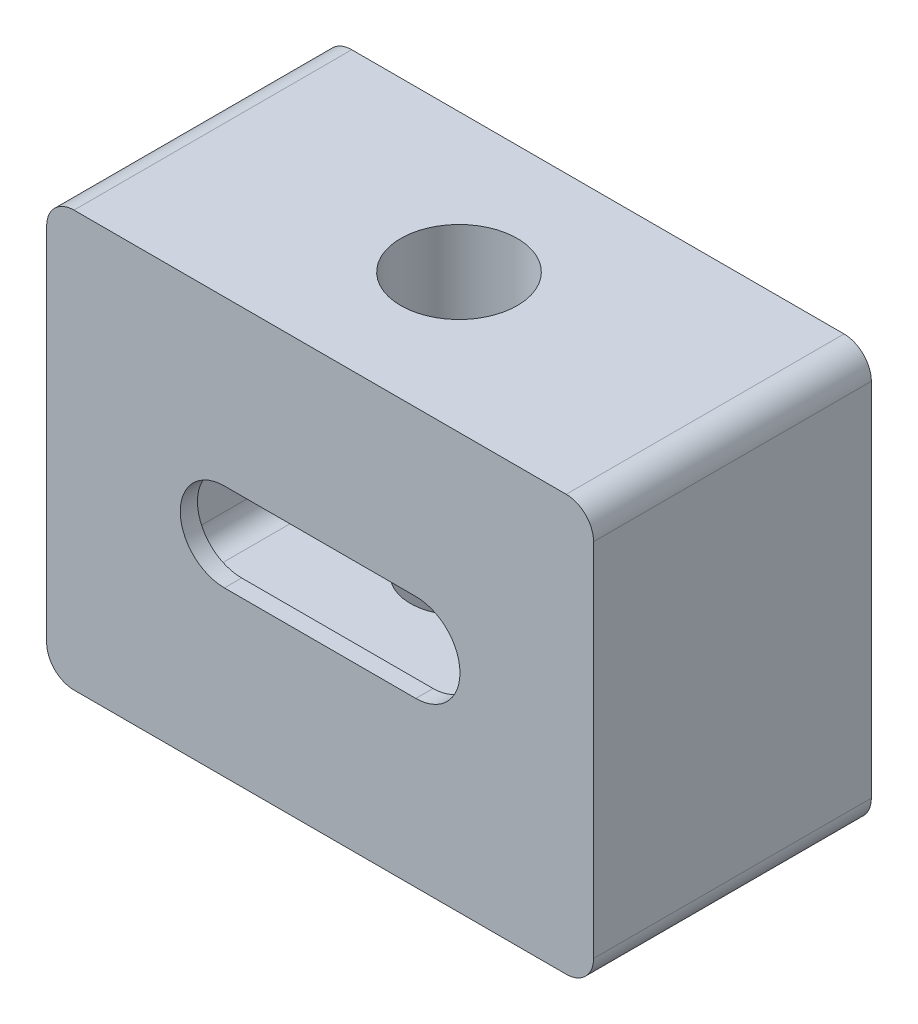
ISO-10303-21;
HEADER;
FILE_DESCRIPTION(('STEP AP214'),'2;1');
FILE_NAME('part.step','',(''),(''),'','','');
FILE_SCHEMA(('AUTOMOTIVE_DESIGN { 1 0 10303 214 1 1 1 1 }'));
ENDSEC;
DATA;
#1=APPLICATION_CONTEXT('core data for automotive mechanical design processes');
#2=APPLICATION_PROTOCOL_DEFINITION('international standard','automotive_design',2000,#1);
#3=PRODUCT_CONTEXT('',#1,'mechanical');
#4=PRODUCT('Part','Part','',(#3));
#5=PRODUCT_RELATED_PRODUCT_CATEGORY('part','',(#4));
#6=PRODUCT_DEFINITION_FORMATION('','',#4);
#7=PRODUCT_DEFINITION_CONTEXT('part definition',#1,'design');
#8=PRODUCT_DEFINITION('design','',#6,#7);
#9=PRODUCT_DEFINITION_SHAPE('','',#8);
#10=(LENGTH_UNIT() NAMED_UNIT(*) SI_UNIT(.MILLI.,.METRE.));
#11=(NAMED_UNIT(*) PLANE_ANGLE_UNIT() SI_UNIT($,.RADIAN.));
#12=(NAMED_UNIT(*) SI_UNIT($,.STERADIAN.) SOLID_ANGLE_UNIT());
#13=UNCERTAINTY_MEASURE_WITH_UNIT(LENGTH_MEASURE(1.E-05),#10,'distance_accuracy_value','');
#14=(GEOMETRIC_REPRESENTATION_CONTEXT(3) GLOBAL_UNCERTAINTY_ASSIGNED_CONTEXT((#13)) GLOBAL_UNIT_ASSIGNED_CONTEXT((#10,
#11,#12)) REPRESENTATION_CONTEXT('',''));
#15=CARTESIAN_POINT('',(0.,0.,0.));
#16=DIRECTION('',(0.,0.,1.));
#17=DIRECTION('',(1.,0.,0.));
#18=AXIS2_PLACEMENT_3D('',#15,#16,#17);
#19=CARTESIAN_POINT('',(0.,9.652,-0.4));
#20=DIRECTION('',(0.,0.,1.));
#21=DIRECTION('',(1.,0.,0.));
#22=AXIS2_PLACEMENT_3D('',#19,#20,#21);
#23=PLANE('',#22);
#24=DIRECTION('',(-1.,0.,0.));
#25=VECTOR('',#24,1.);
#26=CARTESIAN_POINT('',(9.85,3.551,-0.400000000000001));
#27=LINE('',#26,#25);
#28=CARTESIAN_POINT('',(9.35,3.551,-0.400000000000001));
#29=VERTEX_POINT('',#28);
#30=CARTESIAN_POINT('',(3.35,3.551,-0.400000000000001));
#31=VERTEX_POINT('',#30);
#32=EDGE_CURVE('E241',#29,#31,#27,.T.);
#33=ORIENTED_EDGE('',*,*,#32,.T.);
#34=CARTESIAN_POINT('',(3.35,4.051,-0.400000000000001));
#35=DIRECTION('',(0.,0.,1.));
#36=DIRECTION('',(1.,0.,0.));
#37=AXIS2_PLACEMENT_3D('',#34,#35,#36);
#38=CIRCLE('',#37,0.5);
#39=CARTESIAN_POINT('',(2.85,4.051,-0.400000000000001));
#40=VERTEX_POINT('',#39);
#41=EDGE_CURVE('E284',#31,#40,#38,.F.);
#42=ORIENTED_EDGE('',*,*,#41,.T.);
#43=DIRECTION('',(0.,1.,0.));
#44=VECTOR('',#43,1.);
#45=CARTESIAN_POINT('',(2.85,3.551,-0.400000000000001));
#46=LINE('',#45,#44);
#47=CARTESIAN_POINT('',(2.85,5.601,-0.400000000000001));
#48=VERTEX_POINT('',#47);
#49=EDGE_CURVE('E237',#40,#48,#46,.T.);
#50=ORIENTED_EDGE('',*,*,#49,.T.);
#51=CARTESIAN_POINT('',(3.35,5.601,-0.400000000000001));
#52=DIRECTION('',(0.,0.,1.));
#53=DIRECTION('',(1.,0.,0.));
#54=AXIS2_PLACEMENT_3D('',#51,#52,#53);
#55=CIRCLE('',#54,0.5);
#56=CARTESIAN_POINT('',(3.35,6.101,-0.400000000000001));
#57=VERTEX_POINT('',#56);
#58=EDGE_CURVE('E282',#48,#57,#55,.F.);
#59=ORIENTED_EDGE('',*,*,#58,.T.);
#60=DIRECTION('',(1.,0.,0.));
#61=VECTOR('',#60,1.);
#62=CARTESIAN_POINT('',(9.85,6.101,-0.400000000000001));
#63=LINE('',#62,#61);
#64=CARTESIAN_POINT('',(9.35,6.101,-0.400000000000001));
#65=VERTEX_POINT('',#64);
#66=EDGE_CURVE('E225',#57,#65,#63,.T.);
#67=ORIENTED_EDGE('',*,*,#66,.T.);
#68=CARTESIAN_POINT('',(9.35,5.601,-0.400000000000001));
#69=DIRECTION('',(0.,0.,1.));
#70=DIRECTION('',(1.,0.,0.));
#71=AXIS2_PLACEMENT_3D('',#68,#69,#70);
#72=CIRCLE('',#71,0.5);
#73=CARTESIAN_POINT('',(9.85,5.601,-0.400000000000001));
#74=VERTEX_POINT('',#73);
#75=EDGE_CURVE('E278',#65,#74,#72,.F.);
#76=ORIENTED_EDGE('',*,*,#75,.T.);
#77=DIRECTION('',(0.,-1.,0.));
#78=VECTOR('',#77,1.);
#79=CARTESIAN_POINT('',(9.85,3.551,-0.400000000000001));
#80=LINE('',#79,#78);
#81=CARTESIAN_POINT('',(9.85,4.051,-0.400000000000001));
#82=VERTEX_POINT('',#81);
#83=EDGE_CURVE('E236',#74,#82,#80,.T.);
#84=ORIENTED_EDGE('',*,*,#83,.T.);
#85=CARTESIAN_POINT('',(9.35,4.051,-0.400000000000001));
#86=DIRECTION('',(0.,0.,1.));
#87=DIRECTION('',(1.,0.,0.));
#88=AXIS2_PLACEMENT_3D('',#85,#86,#87);
#89=CIRCLE('',#88,0.5);
#90=EDGE_CURVE('E280',#82,#29,#89,.F.);
#91=ORIENTED_EDGE('',*,*,#90,.T.);
#92=EDGE_LOOP('',(#33,#42,#50,#59,#67,#76,#84,#91));
#93=FACE_BOUND('',#92,.T.);
#94=CARTESIAN_POINT('',(8.5725,4.826,-0.4));
#95=DIRECTION('',(0.,0.,-1.));
#96=DIRECTION('',(-1.,0.,0.));
#97=AXIS2_PLACEMENT_3D('',#94,#95,#96);
#98=CIRCLE('',#97,1.025);
#99=CARTESIAN_POINT('',(8.5725,5.851,-0.4));
#100=VERTEX_POINT('',#99);
#101=CARTESIAN_POINT('',(8.5725,3.801,-0.4));
#102=VERTEX_POINT('',#101);
#103=EDGE_CURVE('E182',#100,#102,#98,.T.);
#104=ORIENTED_EDGE('',*,*,#103,.F.);
#105=DIRECTION('',(1.,0.,0.));
#106=VECTOR('',#105,1.);
#107=CARTESIAN_POINT('',(8.5725,5.851,-0.4));
#108=LINE('',#107,#106);
#109=CARTESIAN_POINT('',(4.1275,5.851,-0.4));
#110=VERTEX_POINT('',#109);
#111=EDGE_CURVE('E200',#110,#100,#108,.T.);
#112=ORIENTED_EDGE('',*,*,#111,.F.);
#113=CARTESIAN_POINT('',(4.1275,4.826,-0.4));
#114=DIRECTION('',(0.,0.,-1.));
#115=DIRECTION('',(-1.,0.,0.));
#116=AXIS2_PLACEMENT_3D('',#113,#114,#115);
#117=CIRCLE('',#116,1.025);
#118=CARTESIAN_POINT('',(4.1275,3.801,-0.4));
#119=VERTEX_POINT('',#118);
#120=EDGE_CURVE('E203',#119,#110,#117,.T.);
#121=ORIENTED_EDGE('',*,*,#120,.F.);
#122=DIRECTION('',(-1.,0.,0.));
#123=VECTOR('',#122,1.);
#124=CARTESIAN_POINT('',(8.5725,3.801,-0.4));
#125=LINE('',#124,#123);
#126=EDGE_CURVE('E212',#102,#119,#125,.T.);
#127=ORIENTED_EDGE('',*,*,#126,.F.);
#128=EDGE_LOOP('',(#104,#112,#121,#127));
#129=FACE_BOUND('',#128,.T.);
#130=ADVANCED_FACE('F37',(#93,#129),#23,.F.);
#131=CARTESIAN_POINT('',(0.,9.652,0.));
#132=DIRECTION('',(1.,0.,0.));
#133=DIRECTION('',(0.,0.,-1.));
#134=AXIS2_PLACEMENT_3D('',#131,#132,#133);
#135=PLANE('',#134);
#136=DIRECTION('',(0.,-1.,0.));
#137=VECTOR('',#136,1.);
#138=CARTESIAN_POINT('',(0.,9.652,-6.45));
#139=LINE('',#138,#137);
#140=CARTESIAN_POINT('',(0.,9.017,-6.45));
#141=VERTEX_POINT('',#140);
#142=CARTESIAN_POINT('',(0.,0.635,-6.45));
#143=VERTEX_POINT('',#142);
#144=EDGE_CURVE('E253',#141,#143,#139,.T.);
#145=ORIENTED_EDGE('',*,*,#144,.T.);
#146=DIRECTION('',(0.,0.,1.));
#147=VECTOR('',#146,1.);
#148=CARTESIAN_POINT('',(0.,0.635,0.));
#149=LINE('',#148,#147);
#150=CARTESIAN_POINT('',(0.,0.635,0.));
#151=VERTEX_POINT('',#150);
#152=EDGE_CURVE('E306',#143,#151,#149,.T.);
#153=ORIENTED_EDGE('',*,*,#152,.T.);
#154=DIRECTION('',(0.,-1.,0.));
#155=VECTOR('',#154,1.);
#156=CARTESIAN_POINT('',(0.,9.652,0.));
#157=LINE('',#156,#155);
#158=CARTESIAN_POINT('',(0.,9.017,0.));
#159=VERTEX_POINT('',#158);
#160=EDGE_CURVE('E265',#159,#151,#157,.T.);
#161=ORIENTED_EDGE('',*,*,#160,.F.);
#162=DIRECTION('',(0.,0.,1.));
#163=VECTOR('',#162,1.);
#164=CARTESIAN_POINT('',(0.,9.017,0.));
#165=LINE('',#164,#163);
#166=EDGE_CURVE('E304',#159,#141,#165,.F.);
#167=ORIENTED_EDGE('',*,*,#166,.T.);
#168=EDGE_LOOP('',(#145,#153,#161,#167));
#169=FACE_BOUND('',#168,.T.);
#170=ADVANCED_FACE('F351',(#169),#135,.F.);
#171=CARTESIAN_POINT('',(0.,9.652,0.));
#172=DIRECTION('',(0.,0.,-1.));
#173=DIRECTION('',(-1.,0.,0.));
#174=AXIS2_PLACEMENT_3D('',#171,#172,#173);
#175=PLANE('',#174);
#176=DIRECTION('',(1.,0.,0.));
#177=VECTOR('',#176,1.);
#178=CARTESIAN_POINT('',(8.5725,5.851,0.));
#179=LINE('',#178,#177);
#180=CARTESIAN_POINT('',(4.1275,5.851,0.));
#181=VERTEX_POINT('',#180);
#182=CARTESIAN_POINT('',(8.5725,5.851,0.));
#183=VERTEX_POINT('',#182);
#184=EDGE_CURVE('E187',#181,#183,#179,.T.);
#185=ORIENTED_EDGE('',*,*,#184,.T.);
#186=CARTESIAN_POINT('',(8.5725,4.826,0.));
#187=DIRECTION('',(0.,0.,-1.));
#188=DIRECTION('',(-1.,0.,0.));
#189=AXIS2_PLACEMENT_3D('',#186,#187,#188);
#190=CIRCLE('',#189,1.025);
#191=CARTESIAN_POINT('',(8.5725,3.801,0.));
#192=VERTEX_POINT('',#191);
#193=EDGE_CURVE('E179',#183,#192,#190,.T.);
#194=ORIENTED_EDGE('',*,*,#193,.T.);
#195=DIRECTION('',(-1.,0.,0.));
#196=VECTOR('',#195,1.);
#197=CARTESIAN_POINT('',(8.5725,3.801,0.));
#198=LINE('',#197,#196);
#199=CARTESIAN_POINT('',(4.1275,3.801,0.));
#200=VERTEX_POINT('',#199);
#201=EDGE_CURVE('E191',#192,#200,#198,.T.);
#202=ORIENTED_EDGE('',*,*,#201,.T.);
#203=CARTESIAN_POINT('',(4.1275,4.826,0.));
#204=DIRECTION('',(0.,0.,-1.));
#205=DIRECTION('',(-1.,0.,0.));
#206=AXIS2_PLACEMENT_3D('',#203,#204,#205);
#207=CIRCLE('',#206,1.025);
#208=EDGE_CURVE('E195',#200,#181,#207,.T.);
#209=ORIENTED_EDGE('',*,*,#208,.T.);
#210=EDGE_LOOP('',(#185,#194,#202,#209));
#211=FACE_BOUND('',#210,.T.);
#212=ORIENTED_EDGE('',*,*,#160,.T.);
#213=CARTESIAN_POINT('',(0.635,0.635,0.));
#214=DIRECTION('',(0.,0.,-1.));
#215=DIRECTION('',(-1.,0.,0.));
#216=AXIS2_PLACEMENT_3D('',#213,#214,#215);
#217=CIRCLE('',#216,0.635);
#218=CARTESIAN_POINT('',(0.635,0.,0.));
#219=VERTEX_POINT('',#218);
#220=EDGE_CURVE('E315',#151,#219,#217,.F.);
#221=ORIENTED_EDGE('',*,*,#220,.T.);
#222=DIRECTION('',(1.,0.,0.));
#223=VECTOR('',#222,1.);
#224=CARTESIAN_POINT('',(0.,0.,0.));
#225=LINE('',#224,#223);
#226=CARTESIAN_POINT('',(12.065,0.,0.));
#227=VERTEX_POINT('',#226);
#228=EDGE_CURVE('E240',#219,#227,#225,.T.);
#229=ORIENTED_EDGE('',*,*,#228,.T.);
#230=CARTESIAN_POINT('',(12.065,0.635,0.));
#231=DIRECTION('',(0.,0.,-1.));
#232=DIRECTION('',(-1.,0.,0.));
#233=AXIS2_PLACEMENT_3D('',#230,#231,#232);
#234=CIRCLE('',#233,0.635);
#235=CARTESIAN_POINT('',(12.7,0.635,0.));
#236=VERTEX_POINT('',#235);
#237=EDGE_CURVE('E309',#227,#236,#234,.F.);
#238=ORIENTED_EDGE('',*,*,#237,.T.);
#239=DIRECTION('',(0.,-1.,0.));
#240=VECTOR('',#239,1.);
#241=CARTESIAN_POINT('',(12.7,9.652,0.));
#242=LINE('',#241,#240);
#243=CARTESIAN_POINT('',(12.7,9.017,0.));
#244=VERTEX_POINT('',#243);
#245=EDGE_CURVE('E262',#244,#236,#242,.T.);
#246=ORIENTED_EDGE('',*,*,#245,.F.);
#247=CARTESIAN_POINT('',(12.065,9.017,0.));
#248=DIRECTION('',(0.,0.,-1.));
#249=DIRECTION('',(-1.,0.,0.));
#250=AXIS2_PLACEMENT_3D('',#247,#248,#249);
#251=CIRCLE('',#250,0.635);
#252=CARTESIAN_POINT('',(12.065,9.652,0.));
#253=VERTEX_POINT('',#252);
#254=EDGE_CURVE('E311',#244,#253,#251,.F.);
#255=ORIENTED_EDGE('',*,*,#254,.T.);
#256=DIRECTION('',(1.,0.,0.));
#257=VECTOR('',#256,1.);
#258=CARTESIAN_POINT('',(0.,9.652,0.));
#259=LINE('',#258,#257);
#260=CARTESIAN_POINT('',(0.635,9.652,0.));
#261=VERTEX_POINT('',#260);
#262=EDGE_CURVE('E246',#261,#253,#259,.T.);
#263=ORIENTED_EDGE('',*,*,#262,.F.);
#264=CARTESIAN_POINT('',(0.635,9.017,0.));
#265=DIRECTION('',(0.,0.,-1.));
#266=DIRECTION('',(-1.,0.,0.));
#267=AXIS2_PLACEMENT_3D('',#264,#265,#266);
#268=CIRCLE('',#267,0.635);
#269=EDGE_CURVE('E313',#261,#159,#268,.F.);
#270=ORIENTED_EDGE('',*,*,#269,.T.);
#271=EDGE_LOOP('',(#212,#221,#229,#238,#246,#255,#263,#270));
#272=FACE_BOUND('',#271,.T.);
#273=ADVANCED_FACE('F197',(#211,#272),#175,.F.);
#274=CARTESIAN_POINT('',(12.7,9.652,0.));
#275=DIRECTION('',(-1.,0.,0.));
#276=DIRECTION('',(0.,0.,1.));
#277=AXIS2_PLACEMENT_3D('',#274,#275,#276);
#278=PLANE('',#277);
#279=DIRECTION('',(0.,-1.,0.));
#280=VECTOR('',#279,1.);
#281=CARTESIAN_POINT('',(12.7,9.652,-6.45));
#282=LINE('',#281,#280);
#283=CARTESIAN_POINT('',(12.7,9.017,-6.45));
#284=VERTEX_POINT('',#283);
#285=CARTESIAN_POINT('',(12.7,0.635,-6.45));
#286=VERTEX_POINT('',#285);
#287=EDGE_CURVE('E260',#284,#286,#282,.T.);
#288=ORIENTED_EDGE('',*,*,#287,.F.);
#289=DIRECTION('',(0.,0.,-1.));
#290=VECTOR('',#289,1.);
#291=CARTESIAN_POINT('',(12.7,9.017,0.));
#292=LINE('',#291,#290);
#293=EDGE_CURVE('E12',#284,#244,#292,.F.);
#294=ORIENTED_EDGE('',*,*,#293,.T.);
#295=ORIENTED_EDGE('',*,*,#245,.T.);
#296=DIRECTION('',(0.,0.,-1.));
#297=VECTOR('',#296,1.);
#298=CARTESIAN_POINT('',(12.7,0.635,-6.45));
#299=LINE('',#298,#297);
#300=EDGE_CURVE('E45',#236,#286,#299,.T.);
#301=ORIENTED_EDGE('',*,*,#300,.T.);
#302=EDGE_LOOP('',(#288,#294,#295,#301));
#303=FACE_BOUND('',#302,.T.);
#304=ADVANCED_FACE('F333',(#303),#278,.F.);
#305=CARTESIAN_POINT('',(0.,9.652,-6.45));
#306=DIRECTION('',(0.,0.,1.));
#307=DIRECTION('',(1.,0.,0.));
#308=AXIS2_PLACEMENT_3D('',#305,#306,#307);
#309=PLANE('',#308);
#310=DIRECTION('',(0.,-1.,0.));
#311=VECTOR('',#310,1.);
#312=CARTESIAN_POINT('',(9.85,3.551,-6.45));
#313=LINE('',#312,#311);
#314=CARTESIAN_POINT('',(9.85,5.601,-6.45));
#315=VERTEX_POINT('',#314);
#316=CARTESIAN_POINT('',(9.85,4.051,-6.45));
#317=VERTEX_POINT('',#316);
#318=EDGE_CURVE('E226',#315,#317,#313,.T.);
#319=ORIENTED_EDGE('',*,*,#318,.F.);
#320=CARTESIAN_POINT('',(9.35,5.601,-6.45));
#321=DIRECTION('',(0.,0.,1.));
#322=DIRECTION('',(1.,0.,0.));
#323=AXIS2_PLACEMENT_3D('',#320,#321,#322);
#324=CIRCLE('',#323,0.5);
#325=CARTESIAN_POINT('',(9.35,6.101,-6.45));
#326=VERTEX_POINT('',#325);
#327=EDGE_CURVE('E302',#315,#326,#324,.T.);
#328=ORIENTED_EDGE('',*,*,#327,.T.);
#329=DIRECTION('',(1.,0.,0.));
#330=VECTOR('',#329,1.);
#331=CARTESIAN_POINT('',(9.85,6.101,-6.45));
#332=LINE('',#331,#330);
#333=CARTESIAN_POINT('',(3.35,6.101,-6.45));
#334=VERTEX_POINT('',#333);
#335=EDGE_CURVE('E229',#334,#326,#332,.T.);
#336=ORIENTED_EDGE('',*,*,#335,.F.);
#337=CARTESIAN_POINT('',(3.35,5.601,-6.45));
#338=DIRECTION('',(0.,0.,1.));
#339=DIRECTION('',(1.,0.,0.));
#340=AXIS2_PLACEMENT_3D('',#337,#338,#339);
#341=CIRCLE('',#340,0.5);
#342=CARTESIAN_POINT('',(2.85,5.601,-6.45));
#343=VERTEX_POINT('',#342);
#344=EDGE_CURVE('E298',#334,#343,#341,.T.);
#345=ORIENTED_EDGE('',*,*,#344,.T.);
#346=DIRECTION('',(0.,1.,0.));
#347=VECTOR('',#346,1.);
#348=CARTESIAN_POINT('',(2.85,3.551,-6.45));
#349=LINE('',#348,#347);
#350=CARTESIAN_POINT('',(2.85,4.051,-6.45));
#351=VERTEX_POINT('',#350);
#352=EDGE_CURVE('E217',#351,#343,#349,.T.);
#353=ORIENTED_EDGE('',*,*,#352,.F.);
#354=CARTESIAN_POINT('',(3.35,4.051,-6.45));
#355=DIRECTION('',(0.,0.,1.));
#356=DIRECTION('',(1.,0.,0.));
#357=AXIS2_PLACEMENT_3D('',#354,#355,#356);
#358=CIRCLE('',#357,0.5);
#359=CARTESIAN_POINT('',(3.35,3.551,-6.45));
#360=VERTEX_POINT('',#359);
#361=EDGE_CURVE('E296',#351,#360,#358,.T.);
#362=ORIENTED_EDGE('',*,*,#361,.T.);
#363=DIRECTION('',(-1.,0.,0.));
#364=VECTOR('',#363,1.);
#365=CARTESIAN_POINT('',(9.85,3.551,-6.45));
#366=LINE('',#365,#364);
#367=CARTESIAN_POINT('',(9.35,3.551,-6.45));
#368=VERTEX_POINT('',#367);
#369=EDGE_CURVE('E222',#368,#360,#366,.T.);
#370=ORIENTED_EDGE('',*,*,#369,.F.);
#371=CARTESIAN_POINT('',(9.35,4.051,-6.45));
#372=DIRECTION('',(0.,0.,1.));
#373=DIRECTION('',(1.,0.,0.));
#374=AXIS2_PLACEMENT_3D('',#371,#372,#373);
#375=CIRCLE('',#374,0.5);
#376=EDGE_CURVE('E300',#368,#317,#375,.T.);
#377=ORIENTED_EDGE('',*,*,#376,.T.);
#378=EDGE_LOOP('',(#319,#328,#336,#345,#353,#362,#370,#377));
#379=FACE_BOUND('',#378,.T.);
#380=DIRECTION('',(-1.,0.,0.));
#381=VECTOR('',#380,1.);
#382=CARTESIAN_POINT('',(0.,0.,-6.45));
#383=LINE('',#382,#381);
#384=CARTESIAN_POINT('',(12.065,0.,-6.45));
#385=VERTEX_POINT('',#384);
#386=CARTESIAN_POINT('',(0.635,0.,-6.45));
#387=VERTEX_POINT('',#386);
#388=EDGE_CURVE('E250',#385,#387,#383,.T.);
#389=ORIENTED_EDGE('',*,*,#388,.T.);
#390=CARTESIAN_POINT('',(0.635,0.635,-6.45));
#391=DIRECTION('',(0.,0.,1.));
#392=DIRECTION('',(1.,0.,0.));
#393=AXIS2_PLACEMENT_3D('',#390,#391,#392);
#394=CIRCLE('',#393,0.635);
#395=EDGE_CURVE('E325',#387,#143,#394,.F.);
#396=ORIENTED_EDGE('',*,*,#395,.T.);
#397=ORIENTED_EDGE('',*,*,#144,.F.);
#398=CARTESIAN_POINT('',(0.635,9.017,-6.45));
#399=DIRECTION('',(0.,0.,1.));
#400=DIRECTION('',(1.,0.,0.));
#401=AXIS2_PLACEMENT_3D('',#398,#399,#400);
#402=CIRCLE('',#401,0.635);
#403=CARTESIAN_POINT('',(0.635,9.652,-6.45));
#404=VERTEX_POINT('',#403);
#405=EDGE_CURVE('E323',#141,#404,#402,.F.);
#406=ORIENTED_EDGE('',*,*,#405,.T.);
#407=DIRECTION('',(-1.,0.,0.));
#408=VECTOR('',#407,1.);
#409=CARTESIAN_POINT('',(0.,9.652,-6.45));
#410=LINE('',#409,#408);
#411=CARTESIAN_POINT('',(12.065,9.652,-6.45));
#412=VERTEX_POINT('',#411);
#413=EDGE_CURVE('E249',#412,#404,#410,.T.);
#414=ORIENTED_EDGE('',*,*,#413,.F.);
#415=CARTESIAN_POINT('',(12.065,9.017,-6.45));
#416=DIRECTION('',(0.,0.,1.));
#417=DIRECTION('',(1.,0.,0.));
#418=AXIS2_PLACEMENT_3D('',#415,#416,#417);
#419=CIRCLE('',#418,0.635);
#420=EDGE_CURVE('E60',#412,#284,#419,.F.);
#421=ORIENTED_EDGE('',*,*,#420,.T.);
#422=ORIENTED_EDGE('',*,*,#287,.T.);
#423=CARTESIAN_POINT('',(12.065,0.635,-6.45));
#424=DIRECTION('',(0.,0.,1.));
#425=DIRECTION('',(1.,0.,0.));
#426=AXIS2_PLACEMENT_3D('',#423,#424,#425);
#427=CIRCLE('',#426,0.635);
#428=EDGE_CURVE('E52',#286,#385,#427,.F.);
#429=ORIENTED_EDGE('',*,*,#428,.T.);
#430=EDGE_LOOP('',(#389,#396,#397,#406,#414,#421,#422,#429));
#431=FACE_BOUND('',#430,.T.);
#432=ADVANCED_FACE('F337',(#379,#431),#309,.F.);
#433=CARTESIAN_POINT('',(0.,9.652,0.));
#434=DIRECTION('',(0.,-1.,0.));
#435=DIRECTION('',(0.,0.,-1.));
#436=AXIS2_PLACEMENT_3D('',#433,#434,#435);
#437=PLANE('',#436);
#438=CARTESIAN_POINT('',(6.35,9.652,-3.225));
#439=DIRECTION('',(0.,1.,0.));
#440=DIRECTION('',(0.,0.,1.));
#441=AXIS2_PLACEMENT_3D('',#438,#439,#440);
#442=CIRCLE('',#441,1.35255);
#443=CARTESIAN_POINT('',(6.35,9.652,-1.87245));
#444=VERTEX_POINT('',#443);
#445=EDGE_CURVE('E479',#444,#444,#442,.T.);
#446=ORIENTED_EDGE('',*,*,#445,.F.);
#447=EDGE_LOOP('',(#446));
#448=FACE_BOUND('',#447,.T.);
#449=ORIENTED_EDGE('',*,*,#413,.T.);
#450=DIRECTION('',(0.,0.,1.));
#451=VECTOR('',#450,1.);
#452=CARTESIAN_POINT('',(0.635,9.652,0.));
#453=LINE('',#452,#451);
#454=EDGE_CURVE('E330',#404,#261,#453,.T.);
#455=ORIENTED_EDGE('',*,*,#454,.T.);
#456=ORIENTED_EDGE('',*,*,#262,.T.);
#457=DIRECTION('',(0.,0.,-1.));
#458=VECTOR('',#457,1.);
#459=CARTESIAN_POINT('',(12.065,9.652,0.));
#460=LINE('',#459,#458);
#461=EDGE_CURVE('E327',#253,#412,#460,.T.);
#462=ORIENTED_EDGE('',*,*,#461,.T.);
#463=EDGE_LOOP('',(#449,#455,#456,#462));
#464=FACE_BOUND('',#463,.T.);
#465=ADVANCED_FACE('F358',(#448,#464),#437,.F.);
#466=CARTESIAN_POINT('',(0.,0.,0.));
#467=DIRECTION('',(0.,-1.,0.));
#468=DIRECTION('',(0.,0.,-1.));
#469=AXIS2_PLACEMENT_3D('',#466,#467,#468);
#470=PLANE('',#469);
#471=CARTESIAN_POINT('',(6.35,0.,-3.225));
#472=DIRECTION('',(0.,-1.,0.));
#473=DIRECTION('',(0.,0.,-1.));
#474=AXIS2_PLACEMENT_3D('',#471,#472,#473);
#475=CIRCLE('',#474,1.1303);
#476=CARTESIAN_POINT('',(6.35,0.,-4.3553));
#477=VERTEX_POINT('',#476);
#478=EDGE_CURVE('E478',#477,#477,#475,.T.);
#479=ORIENTED_EDGE('',*,*,#478,.F.);
#480=EDGE_LOOP('',(#479));
#481=FACE_BOUND('',#480,.T.);
#482=ORIENTED_EDGE('',*,*,#228,.F.);
#483=DIRECTION('',(0.,0.,1.));
#484=VECTOR('',#483,1.);
#485=CARTESIAN_POINT('',(0.635,0.,-6.45));
#486=LINE('',#485,#484);
#487=EDGE_CURVE('E319',#219,#387,#486,.F.);
#488=ORIENTED_EDGE('',*,*,#487,.T.);
#489=ORIENTED_EDGE('',*,*,#388,.F.);
#490=DIRECTION('',(0.,0.,-1.));
#491=VECTOR('',#490,1.);
#492=CARTESIAN_POINT('',(12.065,0.,0.));
#493=LINE('',#492,#491);
#494=EDGE_CURVE('E317',#385,#227,#493,.F.);
#495=ORIENTED_EDGE('',*,*,#494,.T.);
#496=EDGE_LOOP('',(#482,#488,#489,#495));
#497=FACE_BOUND('',#496,.T.);
#498=ADVANCED_FACE('F342',(#481,#497),#470,.T.);
#499=CARTESIAN_POINT('',(9.85,6.101,13.1));
#500=DIRECTION('',(0.,1.,0.));
#501=DIRECTION('',(0.,0.,1.));
#502=AXIS2_PLACEMENT_3D('',#499,#500,#501);
#503=PLANE('',#502);
#504=CARTESIAN_POINT('',(6.35,6.101,-3.225));
#505=DIRECTION('',(0.,1.,0.));
#506=DIRECTION('',(0.,0.,1.));
#507=AXIS2_PLACEMENT_3D('',#504,#505,#506);
#508=CIRCLE('',#507,1.35255);
#509=CARTESIAN_POINT('',(6.35,6.101,-1.87245));
#510=VERTEX_POINT('',#509);
#511=EDGE_CURVE('E477',#510,#510,#508,.T.);
#512=ORIENTED_EDGE('',*,*,#511,.T.);
#513=EDGE_LOOP('',(#512));
#514=FACE_BOUND('',#513,.T.);
#515=ORIENTED_EDGE('',*,*,#66,.F.);
#516=DIRECTION('',(0.,0.,-1.));
#517=VECTOR('',#516,1.);
#518=CARTESIAN_POINT('',(3.35,6.101,-6.45));
#519=LINE('',#518,#517);
#520=EDGE_CURVE('E288',#57,#334,#519,.T.);
#521=ORIENTED_EDGE('',*,*,#520,.T.);
#522=ORIENTED_EDGE('',*,*,#335,.T.);
#523=DIRECTION('',(0.,0.,-1.));
#524=VECTOR('',#523,1.);
#525=CARTESIAN_POINT('',(9.35,6.101,-0.400000000000001));
#526=LINE('',#525,#524);
#527=EDGE_CURVE('E286',#326,#65,#526,.F.);
#528=ORIENTED_EDGE('',*,*,#527,.T.);
#529=EDGE_LOOP('',(#515,#521,#522,#528));
#530=FACE_BOUND('',#529,.T.);
#531=ADVANCED_FACE('F379',(#514,#530),#503,.F.);
#532=CARTESIAN_POINT('',(9.85,3.551,13.1));
#533=DIRECTION('',(1.,0.,0.));
#534=DIRECTION('',(0.,0.,-1.));
#535=AXIS2_PLACEMENT_3D('',#532,#533,#534);
#536=PLANE('',#535);
#537=ORIENTED_EDGE('',*,*,#318,.T.);
#538=DIRECTION('',(0.,0.,-1.));
#539=VECTOR('',#538,1.);
#540=CARTESIAN_POINT('',(9.85,4.051,-0.400000000000001));
#541=LINE('',#540,#539);
#542=EDGE_CURVE('E294',#317,#82,#541,.F.);
#543=ORIENTED_EDGE('',*,*,#542,.T.);
#544=ORIENTED_EDGE('',*,*,#83,.F.);
#545=DIRECTION('',(0.,0.,-1.));
#546=VECTOR('',#545,1.);
#547=CARTESIAN_POINT('',(9.85,5.601,-6.45));
#548=LINE('',#547,#546);
#549=EDGE_CURVE('E291',#74,#315,#548,.T.);
#550=ORIENTED_EDGE('',*,*,#549,.T.);
#551=EDGE_LOOP('',(#537,#543,#544,#550));
#552=FACE_BOUND('',#551,.T.);
#553=ADVANCED_FACE('F444',(#552),#536,.F.);
#554=CARTESIAN_POINT('',(9.85,3.551,13.1));
#555=DIRECTION('',(0.,-1.,0.));
#556=DIRECTION('',(0.,0.,-1.));
#557=AXIS2_PLACEMENT_3D('',#554,#555,#556);
#558=PLANE('',#557);
#559=CARTESIAN_POINT('',(6.35,3.551,-3.225));
#560=DIRECTION('',(0.,-1.,0.));
#561=DIRECTION('',(0.,0.,-1.));
#562=AXIS2_PLACEMENT_3D('',#559,#560,#561);
#563=CIRCLE('',#562,1.1303);
#564=CARTESIAN_POINT('',(6.35,3.551,-4.3553));
#565=VERTEX_POINT('',#564);
#566=EDGE_CURVE('E206',#565,#565,#563,.T.);
#567=ORIENTED_EDGE('',*,*,#566,.T.);
#568=EDGE_LOOP('',(#567));
#569=FACE_BOUND('',#568,.T.);
#570=ORIENTED_EDGE('',*,*,#369,.T.);
#571=DIRECTION('',(0.,0.,-1.));
#572=VECTOR('',#571,1.);
#573=CARTESIAN_POINT('',(3.35,3.551,-0.400000000000001));
#574=LINE('',#573,#572);
#575=EDGE_CURVE('E276',#360,#31,#574,.F.);
#576=ORIENTED_EDGE('',*,*,#575,.T.);
#577=ORIENTED_EDGE('',*,*,#32,.F.);
#578=DIRECTION('',(0.,0.,-1.));
#579=VECTOR('',#578,1.);
#580=CARTESIAN_POINT('',(9.35,3.551,-6.45));
#581=LINE('',#580,#579);
#582=EDGE_CURVE('E273',#29,#368,#581,.T.);
#583=ORIENTED_EDGE('',*,*,#582,.T.);
#584=EDGE_LOOP('',(#570,#576,#577,#583));
#585=FACE_BOUND('',#584,.T.);
#586=ADVANCED_FACE('F441',(#569,#585),#558,.F.);
#587=CARTESIAN_POINT('',(2.85,3.551,13.1));
#588=DIRECTION('',(-1.,0.,0.));
#589=DIRECTION('',(0.,0.,1.));
#590=AXIS2_PLACEMENT_3D('',#587,#588,#589);
#591=PLANE('',#590);
#592=ORIENTED_EDGE('',*,*,#49,.F.);
#593=DIRECTION('',(0.,0.,-1.));
#594=VECTOR('',#593,1.);
#595=CARTESIAN_POINT('',(2.85,4.051,-6.45));
#596=LINE('',#595,#594);
#597=EDGE_CURVE('E270',#40,#351,#596,.T.);
#598=ORIENTED_EDGE('',*,*,#597,.T.);
#599=ORIENTED_EDGE('',*,*,#352,.T.);
#600=DIRECTION('',(0.,0.,-1.));
#601=VECTOR('',#600,1.);
#602=CARTESIAN_POINT('',(2.85,5.601,-0.400000000000001));
#603=LINE('',#602,#601);
#604=EDGE_CURVE('E268',#343,#48,#603,.F.);
#605=ORIENTED_EDGE('',*,*,#604,.T.);
#606=EDGE_LOOP('',(#592,#598,#599,#605));
#607=FACE_BOUND('',#606,.T.);
#608=ADVANCED_FACE('F398',(#607),#591,.F.);
#609=CARTESIAN_POINT('',(3.35,4.051,13.1));
#610=DIRECTION('',(0.,0.,1.));
#611=DIRECTION('',(1.,0.,0.));
#612=AXIS2_PLACEMENT_3D('',#609,#610,#611);
#613=CYLINDRICAL_SURFACE('',#612,0.5);
#614=ORIENTED_EDGE('',*,*,#41,.F.);
#615=ORIENTED_EDGE('',*,*,#575,.F.);
#616=ORIENTED_EDGE('',*,*,#361,.F.);
#617=ORIENTED_EDGE('',*,*,#597,.F.);
#618=EDGE_LOOP('',(#614,#615,#616,#617));
#619=FACE_BOUND('',#618,.T.);
#620=ADVANCED_FACE('F394',(#619),#613,.F.);
#621=CARTESIAN_POINT('',(3.35,5.601,13.1));
#622=DIRECTION('',(0.,0.,1.));
#623=DIRECTION('',(1.,0.,0.));
#624=AXIS2_PLACEMENT_3D('',#621,#622,#623);
#625=CYLINDRICAL_SURFACE('',#624,0.5);
#626=ORIENTED_EDGE('',*,*,#58,.F.);
#627=ORIENTED_EDGE('',*,*,#604,.F.);
#628=ORIENTED_EDGE('',*,*,#344,.F.);
#629=ORIENTED_EDGE('',*,*,#520,.F.);
#630=EDGE_LOOP('',(#626,#627,#628,#629));
#631=FACE_BOUND('',#630,.T.);
#632=ADVANCED_FACE('F397',(#631),#625,.F.);
#633=CARTESIAN_POINT('',(9.35,4.051,13.1));
#634=DIRECTION('',(0.,0.,1.));
#635=DIRECTION('',(1.,0.,0.));
#636=AXIS2_PLACEMENT_3D('',#633,#634,#635);
#637=CYLINDRICAL_SURFACE('',#636,0.5);
#638=ORIENTED_EDGE('',*,*,#90,.F.);
#639=ORIENTED_EDGE('',*,*,#542,.F.);
#640=ORIENTED_EDGE('',*,*,#376,.F.);
#641=ORIENTED_EDGE('',*,*,#582,.F.);
#642=EDGE_LOOP('',(#638,#639,#640,#641));
#643=FACE_BOUND('',#642,.T.);
#644=ADVANCED_FACE('F402',(#643),#637,.F.);
#645=CARTESIAN_POINT('',(9.35,5.601,13.1));
#646=DIRECTION('',(0.,0.,1.));
#647=DIRECTION('',(1.,0.,0.));
#648=AXIS2_PLACEMENT_3D('',#645,#646,#647);
#649=CYLINDRICAL_SURFACE('',#648,0.5);
#650=ORIENTED_EDGE('',*,*,#75,.F.);
#651=ORIENTED_EDGE('',*,*,#527,.F.);
#652=ORIENTED_EDGE('',*,*,#327,.F.);
#653=ORIENTED_EDGE('',*,*,#549,.F.);
#654=EDGE_LOOP('',(#650,#651,#652,#653));
#655=FACE_BOUND('',#654,.T.);
#656=ADVANCED_FACE('F406',(#655),#649,.F.);
#657=CARTESIAN_POINT('',(8.5725,4.826,0.));
#658=DIRECTION('',(0.,0.,-1.));
#659=DIRECTION('',(-1.,0.,0.));
#660=AXIS2_PLACEMENT_3D('',#657,#658,#659);
#661=CYLINDRICAL_SURFACE('',#660,1.025);
#662=ORIENTED_EDGE('',*,*,#103,.T.);
#663=DIRECTION('',(0.,0.,-1.));
#664=VECTOR('',#663,1.);
#665=CARTESIAN_POINT('',(8.5725,3.801,0.));
#666=LINE('',#665,#664);
#667=EDGE_CURVE('E175',#192,#102,#666,.T.);
#668=ORIENTED_EDGE('',*,*,#667,.F.);
#669=ORIENTED_EDGE('',*,*,#193,.F.);
#670=DIRECTION('',(0.,0.,-1.));
#671=VECTOR('',#670,1.);
#672=CARTESIAN_POINT('',(8.5725,5.851,0.));
#673=LINE('',#672,#671);
#674=EDGE_CURVE('E215',#183,#100,#673,.T.);
#675=ORIENTED_EDGE('',*,*,#674,.T.);
#676=EDGE_LOOP('',(#662,#668,#669,#675));
#677=FACE_BOUND('',#676,.T.);
#678=ADVANCED_FACE('F177',(#677),#661,.F.);
#679=CARTESIAN_POINT('',(8.5725,5.851,0.));
#680=DIRECTION('',(0.,1.,0.));
#681=DIRECTION('',(0.,0.,1.));
#682=AXIS2_PLACEMENT_3D('',#679,#680,#681);
#683=PLANE('',#682);
#684=ORIENTED_EDGE('',*,*,#111,.T.);
#685=ORIENTED_EDGE('',*,*,#674,.F.);
#686=ORIENTED_EDGE('',*,*,#184,.F.);
#687=DIRECTION('',(0.,0.,-1.));
#688=VECTOR('',#687,1.);
#689=CARTESIAN_POINT('',(4.1275,5.851,0.));
#690=LINE('',#689,#688);
#691=EDGE_CURVE('E218',#181,#110,#690,.T.);
#692=ORIENTED_EDGE('',*,*,#691,.T.);
#693=EDGE_LOOP('',(#684,#685,#686,#692));
#694=FACE_BOUND('',#693,.T.);
#695=ADVANCED_FACE('F427',(#694),#683,.F.);
#696=CARTESIAN_POINT('',(4.1275,4.826,0.));
#697=DIRECTION('',(0.,0.,-1.));
#698=DIRECTION('',(-1.,0.,0.));
#699=AXIS2_PLACEMENT_3D('',#696,#697,#698);
#700=CYLINDRICAL_SURFACE('',#699,1.025);
#701=ORIENTED_EDGE('',*,*,#120,.T.);
#702=ORIENTED_EDGE('',*,*,#691,.F.);
#703=ORIENTED_EDGE('',*,*,#208,.F.);
#704=DIRECTION('',(0.,0.,-1.));
#705=VECTOR('',#704,1.);
#706=CARTESIAN_POINT('',(4.1275,3.801,0.));
#707=LINE('',#706,#705);
#708=EDGE_CURVE('E186',#200,#119,#707,.T.);
#709=ORIENTED_EDGE('',*,*,#708,.T.);
#710=EDGE_LOOP('',(#701,#702,#703,#709));
#711=FACE_BOUND('',#710,.T.);
#712=ADVANCED_FACE('F430',(#711),#700,.F.);
#713=CARTESIAN_POINT('',(8.5725,3.801,0.));
#714=DIRECTION('',(0.,-1.,0.));
#715=DIRECTION('',(0.,0.,-1.));
#716=AXIS2_PLACEMENT_3D('',#713,#714,#715);
#717=PLANE('',#716);
#718=ORIENTED_EDGE('',*,*,#126,.T.);
#719=ORIENTED_EDGE('',*,*,#708,.F.);
#720=ORIENTED_EDGE('',*,*,#201,.F.);
#721=ORIENTED_EDGE('',*,*,#667,.T.);
#722=EDGE_LOOP('',(#718,#719,#720,#721));
#723=FACE_BOUND('',#722,.T.);
#724=ADVANCED_FACE('F192',(#723),#717,.F.);
#725=CARTESIAN_POINT('',(6.35,0.,-3.225));
#726=DIRECTION('',(0.,-1.,0.));
#727=DIRECTION('',(0.,0.,-1.));
#728=AXIS2_PLACEMENT_3D('',#725,#726,#727);
#729=CYLINDRICAL_SURFACE('',#728,1.1303);
#730=ORIENTED_EDGE('',*,*,#566,.F.);
#731=EDGE_LOOP('',(#730));
#732=FACE_BOUND('',#731,.T.);
#733=ORIENTED_EDGE('',*,*,#478,.T.);
#734=EDGE_LOOP('',(#733));
#735=FACE_BOUND('',#734,.T.);
#736=ADVANCED_FACE('F416',(#732,#735),#729,.F.);
#737=CARTESIAN_POINT('',(6.35,9.652,-3.225));
#738=DIRECTION('',(0.,1.,0.));
#739=DIRECTION('',(0.,0.,1.));
#740=AXIS2_PLACEMENT_3D('',#737,#738,#739);
#741=CYLINDRICAL_SURFACE('',#740,1.35255);
#742=ORIENTED_EDGE('',*,*,#511,.F.);
#743=EDGE_LOOP('',(#742));
#744=FACE_BOUND('',#743,.T.);
#745=ORIENTED_EDGE('',*,*,#445,.T.);
#746=EDGE_LOOP('',(#745));
#747=FACE_BOUND('',#746,.T.);
#748=ADVANCED_FACE('F412',(#744,#747),#741,.F.);
#749=CARTESIAN_POINT('',(0.635,0.635,0.));
#750=DIRECTION('',(0.,0.,-1.));
#751=DIRECTION('',(-1.,0.,0.));
#752=AXIS2_PLACEMENT_3D('',#749,#750,#751);
#753=CYLINDRICAL_SURFACE('',#752,0.635);
#754=ORIENTED_EDGE('',*,*,#395,.F.);
#755=ORIENTED_EDGE('',*,*,#487,.F.);
#756=ORIENTED_EDGE('',*,*,#220,.F.);
#757=ORIENTED_EDGE('',*,*,#152,.F.);
#758=EDGE_LOOP('',(#754,#755,#756,#757));
#759=FACE_BOUND('',#758,.T.);
#760=ADVANCED_FACE('F346',(#759),#753,.T.);
#761=CARTESIAN_POINT('',(0.635,9.017,0.));
#762=DIRECTION('',(0.,0.,1.));
#763=DIRECTION('',(1.,0.,0.));
#764=AXIS2_PLACEMENT_3D('',#761,#762,#763);
#765=CYLINDRICAL_SURFACE('',#764,0.635);
#766=ORIENTED_EDGE('',*,*,#405,.F.);
#767=ORIENTED_EDGE('',*,*,#166,.F.);
#768=ORIENTED_EDGE('',*,*,#269,.F.);
#769=ORIENTED_EDGE('',*,*,#454,.F.);
#770=EDGE_LOOP('',(#766,#767,#768,#769));
#771=FACE_BOUND('',#770,.T.);
#772=ADVANCED_FACE('F355',(#771),#765,.T.);
#773=CARTESIAN_POINT('',(12.065,9.017,0.));
#774=DIRECTION('',(0.,0.,-1.));
#775=DIRECTION('',(-1.,0.,0.));
#776=AXIS2_PLACEMENT_3D('',#773,#774,#775);
#777=CYLINDRICAL_SURFACE('',#776,0.635);
#778=ORIENTED_EDGE('',*,*,#254,.F.);
#779=ORIENTED_EDGE('',*,*,#293,.F.);
#780=ORIENTED_EDGE('',*,*,#420,.F.);
#781=ORIENTED_EDGE('',*,*,#461,.F.);
#782=EDGE_LOOP('',(#778,#779,#780,#781));
#783=FACE_BOUND('',#782,.T.);
#784=ADVANCED_FACE('F362',(#783),#777,.T.);
#785=CARTESIAN_POINT('',(12.065,0.635,0.));
#786=DIRECTION('',(0.,0.,1.));
#787=DIRECTION('',(1.,0.,0.));
#788=AXIS2_PLACEMENT_3D('',#785,#786,#787);
#789=CYLINDRICAL_SURFACE('',#788,0.635);
#790=ORIENTED_EDGE('',*,*,#237,.F.);
#791=ORIENTED_EDGE('',*,*,#494,.F.);
#792=ORIENTED_EDGE('',*,*,#428,.F.);
#793=ORIENTED_EDGE('',*,*,#300,.F.);
#794=EDGE_LOOP('',(#790,#791,#792,#793));
#795=FACE_BOUND('',#794,.T.);
#796=ADVANCED_FACE('F39',(#795),#789,.T.);
#797=CLOSED_SHELL('',(#130,#170,#273,#304,#432,#465,#498,#531,#553,#586,#608,#620,#632,#644,
#656,#678,#695,#712,#724,#736,#748,#760,#772,#784,#796));
#798=MANIFOLD_SOLID_BREP('B2',#797);
#799=ADVANCED_BREP_SHAPE_REPRESENTATION('',(#18,#798),#14);
#800=SHAPE_DEFINITION_REPRESENTATION(#9,#799);
ENDSEC;
END-ISO-10303-21;
